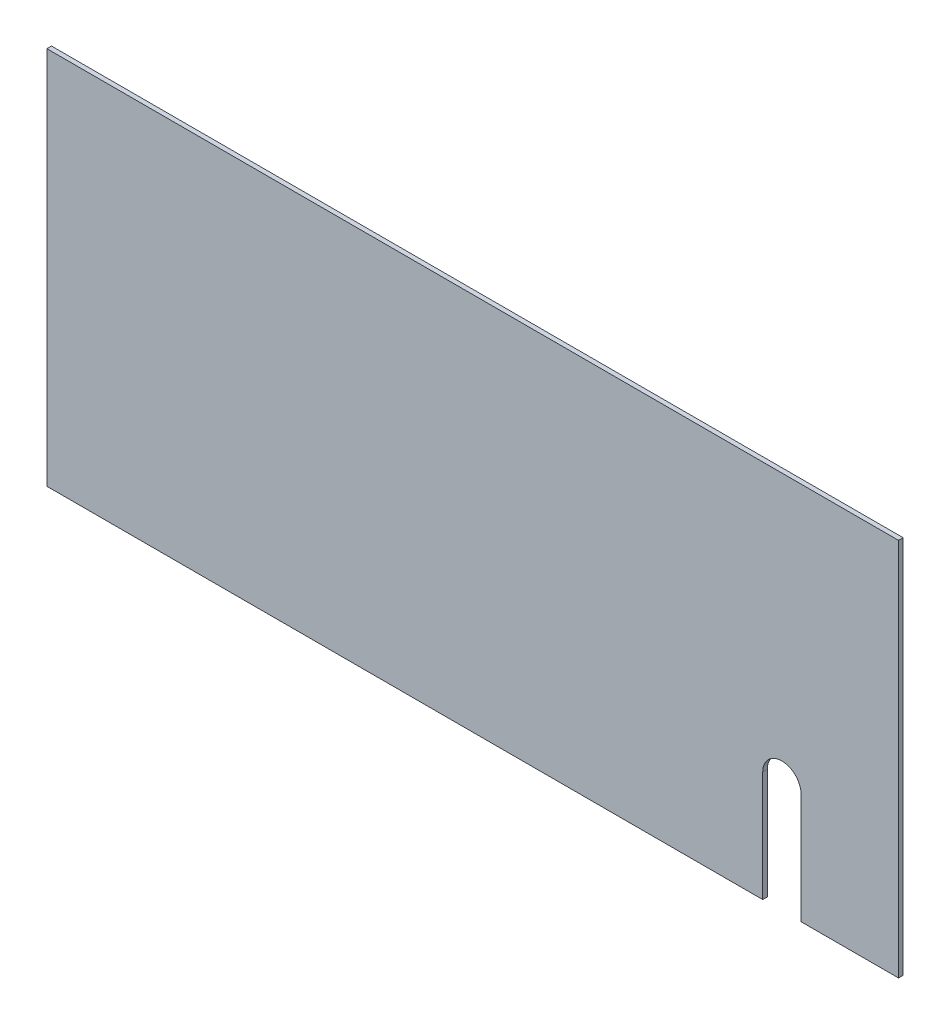
ISO-10303-21;
HEADER;
FILE_DESCRIPTION(('STEP AP214'),'2;1');
FILE_NAME('part.step','',(''),(''),'','','');
FILE_SCHEMA(('AUTOMOTIVE_DESIGN { 1 0 10303 214 1 1 1 1 }'));
ENDSEC;
DATA;
#1=APPLICATION_CONTEXT('core data for automotive mechanical design processes');
#2=APPLICATION_PROTOCOL_DEFINITION('international standard','automotive_design',2000,#1);
#3=PRODUCT_CONTEXT('',#1,'mechanical');
#4=PRODUCT('Part','Part','',(#3));
#5=PRODUCT_RELATED_PRODUCT_CATEGORY('part','',(#4));
#6=PRODUCT_DEFINITION_FORMATION('','',#4);
#7=PRODUCT_DEFINITION_CONTEXT('part definition',#1,'design');
#8=PRODUCT_DEFINITION('design','',#6,#7);
#9=PRODUCT_DEFINITION_SHAPE('','',#8);
#10=(LENGTH_UNIT() NAMED_UNIT(*) SI_UNIT(.MILLI.,.METRE.));
#11=(NAMED_UNIT(*) PLANE_ANGLE_UNIT() SI_UNIT($,.RADIAN.));
#12=(NAMED_UNIT(*) SI_UNIT($,.STERADIAN.) SOLID_ANGLE_UNIT());
#13=UNCERTAINTY_MEASURE_WITH_UNIT(LENGTH_MEASURE(1.E-05),#10,'distance_accuracy_value','');
#14=(GEOMETRIC_REPRESENTATION_CONTEXT(3) GLOBAL_UNCERTAINTY_ASSIGNED_CONTEXT((#13)) GLOBAL_UNIT_ASSIGNED_CONTEXT((#10,
#11,#12)) REPRESENTATION_CONTEXT('',''));
#15=CARTESIAN_POINT('',(0.,0.,0.));
#16=DIRECTION('',(0.,0.,1.));
#17=DIRECTION('',(1.,0.,0.));
#18=AXIS2_PLACEMENT_3D('',#15,#16,#17);
#19=CARTESIAN_POINT('',(267.256688430674,-2.16617363985669,3.));
#20=DIRECTION('',(0.,1.,0.));
#21=DIRECTION('',(-1.,0.,0.));
#22=AXIS2_PLACEMENT_3D('',#19,#20,#21);
#23=PLANE('',#22);
#24=DIRECTION('',(1.,0.,0.));
#25=VECTOR('',#24,1.);
#26=CARTESIAN_POINT('',(267.256688430674,-2.16617363985669,3.));
#27=LINE('',#26,#25);
#28=CARTESIAN_POINT('',(203.756688430674,-2.16617363985676,3.));
#29=VERTEX_POINT('',#28);
#30=CARTESIAN_POINT('',(267.256688430674,-2.16617363985669,3.));
#31=VERTEX_POINT('',#30);
#32=EDGE_CURVE('E57',#29,#31,#27,.T.);
#33=ORIENTED_EDGE('',*,*,#32,.F.);
#34=DIRECTION('',(0.,0.,1.));
#35=VECTOR('',#34,1.);
#36=CARTESIAN_POINT('',(203.756688430674,-2.16617363985676,-69.));
#37=LINE('',#36,#35);
#38=CARTESIAN_POINT('',(203.756688430674,-2.16617363985676,0.));
#39=VERTEX_POINT('',#38);
#40=EDGE_CURVE('E133',#39,#29,#37,.T.);
#41=ORIENTED_EDGE('',*,*,#40,.F.);
#42=DIRECTION('',(1.,0.,0.));
#43=VECTOR('',#42,1.);
#44=CARTESIAN_POINT('',(267.256688430674,-2.16617363985669,0.));
#45=LINE('',#44,#43);
#46=CARTESIAN_POINT('',(267.256688430674,-2.16617363985669,0.));
#47=VERTEX_POINT('',#46);
#48=EDGE_CURVE('E79',#39,#47,#45,.T.);
#49=ORIENTED_EDGE('',*,*,#48,.T.);
#50=DIRECTION('',(0.,0.,-1.));
#51=VECTOR('',#50,1.);
#52=CARTESIAN_POINT('',(267.256688430674,-2.16617363985669,3.));
#53=LINE('',#52,#51);
#54=EDGE_CURVE('E143',#31,#47,#53,.T.);
#55=ORIENTED_EDGE('',*,*,#54,.F.);
#56=EDGE_LOOP('',(#33,#41,#49,#55));
#57=FACE_BOUND('',#56,.T.);
#58=ADVANCED_FACE('F33',(#57),#23,.F.);
#59=CARTESIAN_POINT('',(267.256688430674,-2.16617363985669,3.));
#60=DIRECTION('',(-1.,0.,0.));
#61=DIRECTION('',(0.,0.,1.));
#62=AXIS2_PLACEMENT_3D('',#59,#60,#61);
#63=PLANE('',#62);
#64=DIRECTION('',(0.,1.,0.));
#65=VECTOR('',#64,1.);
#66=CARTESIAN_POINT('',(267.256688430674,-2.16617363985669,0.));
#67=LINE('',#66,#65);
#68=CARTESIAN_POINT('',(267.256688430674,244.833826360143,0.));
#69=VERTEX_POINT('',#68);
#70=EDGE_CURVE('E132',#47,#69,#67,.T.);
#71=ORIENTED_EDGE('',*,*,#70,.T.);
#72=DIRECTION('',(0.,0.,-1.));
#73=VECTOR('',#72,1.);
#74=CARTESIAN_POINT('',(267.256688430674,244.833826360143,3.));
#75=LINE('',#74,#73);
#76=CARTESIAN_POINT('',(267.256688430674,244.833826360143,3.));
#77=VERTEX_POINT('',#76);
#78=EDGE_CURVE('E159',#77,#69,#75,.T.);
#79=ORIENTED_EDGE('',*,*,#78,.F.);
#80=DIRECTION('',(0.,1.,0.));
#81=VECTOR('',#80,1.);
#82=CARTESIAN_POINT('',(267.256688430674,-2.16617363985669,3.));
#83=LINE('',#82,#81);
#84=EDGE_CURVE('E136',#31,#77,#83,.T.);
#85=ORIENTED_EDGE('',*,*,#84,.F.);
#86=ORIENTED_EDGE('',*,*,#54,.T.);
#87=EDGE_LOOP('',(#71,#79,#85,#86));
#88=FACE_BOUND('',#87,.T.);
#89=ADVANCED_FACE('F35',(#88),#63,.F.);
#90=CARTESIAN_POINT('',(267.256688430674,244.833826360143,3.));
#91=DIRECTION('',(0.,-1.,0.));
#92=DIRECTION('',(1.,0.,0.));
#93=AXIS2_PLACEMENT_3D('',#90,#91,#92);
#94=PLANE('',#93);
#95=DIRECTION('',(-1.,0.,0.));
#96=VECTOR('',#95,1.);
#97=CARTESIAN_POINT('',(267.256688430674,244.833826360143,0.));
#98=LINE('',#97,#96);
#99=CARTESIAN_POINT('',(-287.743311569326,244.833826360143,0.));
#100=VERTEX_POINT('',#99);
#101=EDGE_CURVE('E146',#69,#100,#98,.T.);
#102=ORIENTED_EDGE('',*,*,#101,.T.);
#103=DIRECTION('',(0.,0.,-1.));
#104=VECTOR('',#103,1.);
#105=CARTESIAN_POINT('',(-287.743311569326,244.833826360143,3.));
#106=LINE('',#105,#104);
#107=CARTESIAN_POINT('',(-287.743311569326,244.833826360143,3.));
#108=VERTEX_POINT('',#107);
#109=EDGE_CURVE('E156',#108,#100,#106,.T.);
#110=ORIENTED_EDGE('',*,*,#109,.F.);
#111=DIRECTION('',(-1.,0.,0.));
#112=VECTOR('',#111,1.);
#113=CARTESIAN_POINT('',(267.256688430674,244.833826360143,3.));
#114=LINE('',#113,#112);
#115=EDGE_CURVE('E87',#77,#108,#114,.T.);
#116=ORIENTED_EDGE('',*,*,#115,.F.);
#117=ORIENTED_EDGE('',*,*,#78,.T.);
#118=EDGE_LOOP('',(#102,#110,#116,#117));
#119=FACE_BOUND('',#118,.T.);
#120=ADVANCED_FACE('F172',(#119),#94,.F.);
#121=CARTESIAN_POINT('',(-287.743311569326,-2.16617363985676,3.));
#122=DIRECTION('',(1.,0.,0.));
#123=DIRECTION('',(0.,0.,-1.));
#124=AXIS2_PLACEMENT_3D('',#121,#122,#123);
#125=PLANE('',#124);
#126=DIRECTION('',(0.,-1.,0.));
#127=VECTOR('',#126,1.);
#128=CARTESIAN_POINT('',(-287.743311569326,-2.16617363985676,0.));
#129=LINE('',#128,#127);
#130=CARTESIAN_POINT('',(-287.743311569326,-2.16617363985676,0.));
#131=VERTEX_POINT('',#130);
#132=EDGE_CURVE('E148',#100,#131,#129,.T.);
#133=ORIENTED_EDGE('',*,*,#132,.T.);
#134=DIRECTION('',(0.,0.,-1.));
#135=VECTOR('',#134,1.);
#136=CARTESIAN_POINT('',(-287.743311569326,-2.16617363985676,3.));
#137=LINE('',#136,#135);
#138=CARTESIAN_POINT('',(-287.743311569326,-2.16617363985676,3.));
#139=VERTEX_POINT('',#138);
#140=EDGE_CURVE('E153',#139,#131,#137,.T.);
#141=ORIENTED_EDGE('',*,*,#140,.F.);
#142=DIRECTION('',(0.,-1.,0.));
#143=VECTOR('',#142,1.);
#144=CARTESIAN_POINT('',(-287.743311569326,-2.16617363985676,3.));
#145=LINE('',#144,#143);
#146=EDGE_CURVE('E140',#108,#139,#145,.T.);
#147=ORIENTED_EDGE('',*,*,#146,.F.);
#148=ORIENTED_EDGE('',*,*,#109,.T.);
#149=EDGE_LOOP('',(#133,#141,#147,#148));
#150=FACE_BOUND('',#149,.T.);
#151=ADVANCED_FACE('F175',(#150),#125,.F.);
#152=CARTESIAN_POINT('',(178.756688430674,-2.16617363985671,0.));
#153=VERTEX_POINT('',#152);
#154=EDGE_CURVE('E138',#131,#153,#45,.T.);
#155=ORIENTED_EDGE('',*,*,#154,.T.);
#156=DIRECTION('',(0.,0.,1.));
#157=VECTOR('',#156,1.);
#158=CARTESIAN_POINT('',(178.756688430674,-2.16617363985676,-69.));
#159=LINE('',#158,#157);
#160=CARTESIAN_POINT('',(178.756688430674,-2.16617363985676,3.));
#161=VERTEX_POINT('',#160);
#162=EDGE_CURVE('E48',#153,#161,#159,.T.);
#163=ORIENTED_EDGE('',*,*,#162,.T.);
#164=EDGE_CURVE('E127',#139,#161,#27,.T.);
#165=ORIENTED_EDGE('',*,*,#164,.F.);
#166=ORIENTED_EDGE('',*,*,#140,.T.);
#167=EDGE_LOOP('',(#155,#163,#165,#166));
#168=FACE_BOUND('',#167,.T.);
#169=ADVANCED_FACE('F177',(#168),#23,.F.);
#170=CARTESIAN_POINT('',(0.,0.,3.));
#171=DIRECTION('',(0.,0.,1.));
#172=DIRECTION('',(1.,0.,0.));
#173=AXIS2_PLACEMENT_3D('',#170,#171,#172);
#174=PLANE('',#173);
#175=DIRECTION('',(0.,1.,0.));
#176=VECTOR('',#175,1.);
#177=CARTESIAN_POINT('',(203.756688430674,-2.16617363985676,3.));
#178=LINE('',#177,#176);
#179=CARTESIAN_POINT('',(203.756688430674,69.8338263601432,3.));
#180=VERTEX_POINT('',#179);
#181=EDGE_CURVE('E115',#29,#180,#178,.T.);
#182=ORIENTED_EDGE('',*,*,#181,.F.);
#183=ORIENTED_EDGE('',*,*,#32,.T.);
#184=ORIENTED_EDGE('',*,*,#84,.T.);
#185=ORIENTED_EDGE('',*,*,#115,.T.);
#186=ORIENTED_EDGE('',*,*,#146,.T.);
#187=ORIENTED_EDGE('',*,*,#164,.T.);
#188=DIRECTION('',(0.,-1.,0.));
#189=VECTOR('',#188,1.);
#190=CARTESIAN_POINT('',(178.756688430674,69.8338263601432,3.));
#191=LINE('',#190,#189);
#192=CARTESIAN_POINT('',(178.756688430674,69.8338263601432,3.));
#193=VERTEX_POINT('',#192);
#194=EDGE_CURVE('E111',#193,#161,#191,.T.);
#195=ORIENTED_EDGE('',*,*,#194,.F.);
#196=CARTESIAN_POINT('',(191.256688430674,69.8338263601432,3.));
#197=DIRECTION('',(0.,0.,1.));
#198=DIRECTION('',(1.,0.,0.));
#199=AXIS2_PLACEMENT_3D('',#196,#197,#198);
#200=CIRCLE('',#199,12.5);
#201=EDGE_CURVE('E118',#180,#193,#200,.T.);
#202=ORIENTED_EDGE('',*,*,#201,.F.);
#203=EDGE_LOOP('',(#182,#183,#184,#185,#186,#187,#195,#202));
#204=FACE_BOUND('',#203,.T.);
#205=ADVANCED_FACE('F125',(#204),#174,.T.);
#206=CARTESIAN_POINT('',(0.,0.,0.));
#207=DIRECTION('',(0.,0.,1.));
#208=DIRECTION('',(1.,0.,0.));
#209=AXIS2_PLACEMENT_3D('',#206,#207,#208);
#210=PLANE('',#209);
#211=ORIENTED_EDGE('',*,*,#48,.F.);
#212=DIRECTION('',(0.,1.,0.));
#213=VECTOR('',#212,1.);
#214=CARTESIAN_POINT('',(203.756688430674,0.,0.));
#215=LINE('',#214,#213);
#216=CARTESIAN_POINT('',(203.756688430674,69.8338263601432,0.));
#217=VERTEX_POINT('',#216);
#218=EDGE_CURVE('E11',#39,#217,#215,.T.);
#219=ORIENTED_EDGE('',*,*,#218,.T.);
#220=CARTESIAN_POINT('',(191.256688430674,69.8338263601432,0.));
#221=DIRECTION('',(0.,0.,1.));
#222=DIRECTION('',(1.,0.,0.));
#223=AXIS2_PLACEMENT_3D('',#220,#221,#222);
#224=CIRCLE('',#223,12.5);
#225=CARTESIAN_POINT('',(178.756688430674,69.8338263601432,0.));
#226=VERTEX_POINT('',#225);
#227=EDGE_CURVE('E41',#217,#226,#224,.T.);
#228=ORIENTED_EDGE('',*,*,#227,.T.);
#229=DIRECTION('',(0.,-1.,0.));
#230=VECTOR('',#229,1.);
#231=CARTESIAN_POINT('',(178.756688430674,0.,0.));
#232=LINE('',#231,#230);
#233=EDGE_CURVE('E112',#226,#153,#232,.T.);
#234=ORIENTED_EDGE('',*,*,#233,.T.);
#235=ORIENTED_EDGE('',*,*,#154,.F.);
#236=ORIENTED_EDGE('',*,*,#132,.F.);
#237=ORIENTED_EDGE('',*,*,#101,.F.);
#238=ORIENTED_EDGE('',*,*,#70,.F.);
#239=EDGE_LOOP('',(#211,#219,#228,#234,#235,#236,#237,#238));
#240=FACE_BOUND('',#239,.T.);
#241=ADVANCED_FACE('F162',(#240),#210,.F.);
#242=CARTESIAN_POINT('',(191.256688430674,69.8338263601432,-69.));
#243=DIRECTION('',(0.,0.,1.));
#244=DIRECTION('',(1.,0.,0.));
#245=AXIS2_PLACEMENT_3D('',#242,#243,#244);
#246=CYLINDRICAL_SURFACE('',#245,12.5);
#247=DIRECTION('',(0.,0.,1.));
#248=VECTOR('',#247,1.);
#249=CARTESIAN_POINT('',(203.756688430674,69.8338263601432,-69.));
#250=LINE('',#249,#248);
#251=EDGE_CURVE('E121',#217,#180,#250,.T.);
#252=ORIENTED_EDGE('',*,*,#251,.T.);
#253=ORIENTED_EDGE('',*,*,#201,.T.);
#254=DIRECTION('',(0.,0.,1.));
#255=VECTOR('',#254,1.);
#256=CARTESIAN_POINT('',(178.756688430674,69.8338263601432,-69.));
#257=LINE('',#256,#255);
#258=EDGE_CURVE('E107',#226,#193,#257,.T.);
#259=ORIENTED_EDGE('',*,*,#258,.F.);
#260=ORIENTED_EDGE('',*,*,#227,.F.);
#261=EDGE_LOOP('',(#252,#253,#259,#260));
#262=FACE_BOUND('',#261,.T.);
#263=ADVANCED_FACE('F119',(#262),#246,.F.);
#264=CARTESIAN_POINT('',(203.756688430674,-2.16617363985676,-69.));
#265=DIRECTION('',(1.,0.,0.));
#266=DIRECTION('',(0.,0.,-1.));
#267=AXIS2_PLACEMENT_3D('',#264,#265,#266);
#268=PLANE('',#267);
#269=ORIENTED_EDGE('',*,*,#40,.T.);
#270=ORIENTED_EDGE('',*,*,#181,.T.);
#271=ORIENTED_EDGE('',*,*,#251,.F.);
#272=ORIENTED_EDGE('',*,*,#218,.F.);
#273=EDGE_LOOP('',(#269,#270,#271,#272));
#274=FACE_BOUND('',#273,.T.);
#275=ADVANCED_FACE('F165',(#274),#268,.F.);
#276=CARTESIAN_POINT('',(178.756688430674,69.8338263601432,-69.));
#277=DIRECTION('',(-1.,0.,0.));
#278=DIRECTION('',(0.,-1.,0.));
#279=AXIS2_PLACEMENT_3D('',#276,#277,#278);
#280=PLANE('',#279);
#281=ORIENTED_EDGE('',*,*,#258,.T.);
#282=ORIENTED_EDGE('',*,*,#194,.T.);
#283=ORIENTED_EDGE('',*,*,#162,.F.);
#284=ORIENTED_EDGE('',*,*,#233,.F.);
#285=EDGE_LOOP('',(#281,#282,#283,#284));
#286=FACE_BOUND('',#285,.T.);
#287=ADVANCED_FACE('F109',(#286),#280,.F.);
#288=CLOSED_SHELL('',(#58,#89,#120,#151,#169,#205,#241,#263,#275,#287));
#289=MANIFOLD_SOLID_BREP('B2',#288);
#290=ADVANCED_BREP_SHAPE_REPRESENTATION('',(#18,#289),#14);
#291=SHAPE_DEFINITION_REPRESENTATION(#9,#290);
ENDSEC;
END-ISO-10303-21;
